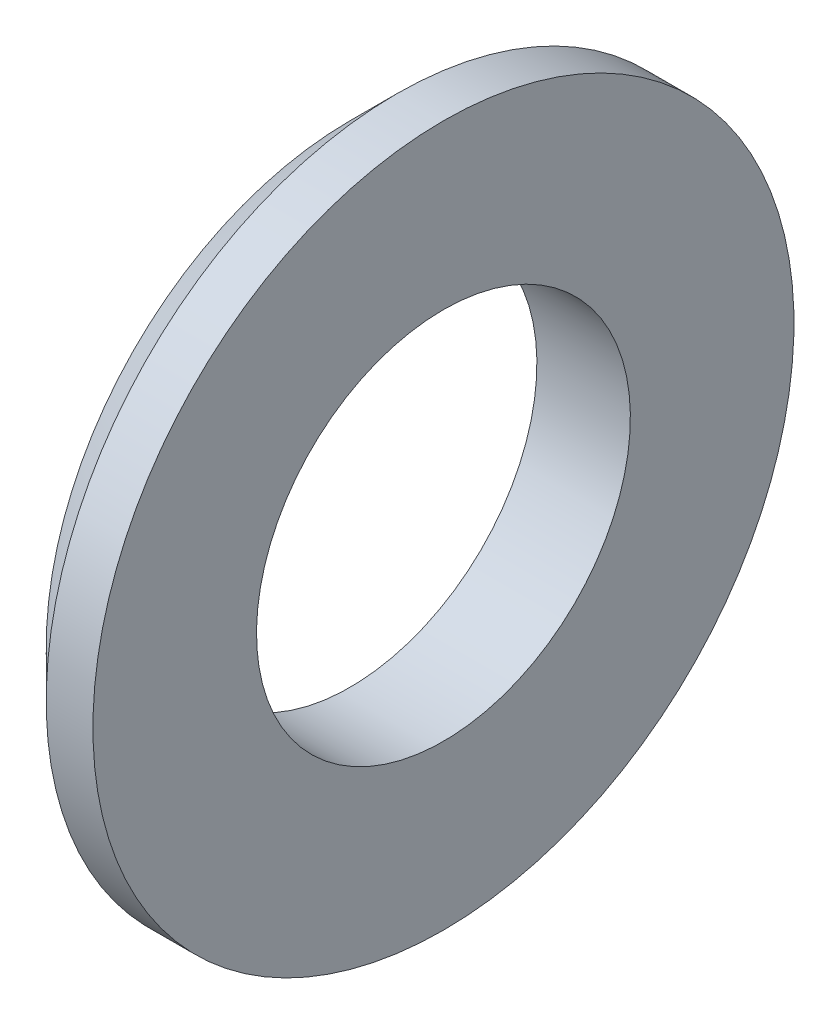
ISO-10303-21;
HEADER;
FILE_DESCRIPTION(('STEP AP214'),'2;1');
FILE_NAME('part.step','',(''),(''),'','','');
FILE_SCHEMA(('AUTOMOTIVE_DESIGN { 1 0 10303 214 1 1 1 1 }'));
ENDSEC;
DATA;
#1=APPLICATION_CONTEXT('core data for automotive mechanical design processes');
#2=APPLICATION_PROTOCOL_DEFINITION('international standard','automotive_design',2000,#1);
#3=PRODUCT_CONTEXT('',#1,'mechanical');
#4=PRODUCT('Part','Part','',(#3));
#5=PRODUCT_RELATED_PRODUCT_CATEGORY('part','',(#4));
#6=PRODUCT_DEFINITION_FORMATION('','',#4);
#7=PRODUCT_DEFINITION_CONTEXT('part definition',#1,'design');
#8=PRODUCT_DEFINITION('design','',#6,#7);
#9=PRODUCT_DEFINITION_SHAPE('','',#8);
#10=(LENGTH_UNIT() NAMED_UNIT(*) SI_UNIT(.MILLI.,.METRE.));
#11=(NAMED_UNIT(*) PLANE_ANGLE_UNIT() SI_UNIT($,.RADIAN.));
#12=(NAMED_UNIT(*) SI_UNIT($,.STERADIAN.) SOLID_ANGLE_UNIT());
#13=UNCERTAINTY_MEASURE_WITH_UNIT(LENGTH_MEASURE(1.E-05),#10,'distance_accuracy_value','');
#14=(GEOMETRIC_REPRESENTATION_CONTEXT(3) GLOBAL_UNCERTAINTY_ASSIGNED_CONTEXT((#13)) GLOBAL_UNIT_ASSIGNED_CONTEXT((#10,
#11,#12)) REPRESENTATION_CONTEXT('',''));
#15=CARTESIAN_POINT('',(0.,0.,0.));
#16=DIRECTION('',(0.,0.,1.));
#17=DIRECTION('',(1.,0.,0.));
#18=AXIS2_PLACEMENT_3D('',#15,#16,#17);
#19=CARTESIAN_POINT('',(1.6,0.,0.));
#20=DIRECTION('',(-1.,0.,0.));
#21=DIRECTION('',(0.,0.,1.));
#22=AXIS2_PLACEMENT_3D('',#19,#20,#21);
#23=PLANE('',#22);
#24=CARTESIAN_POINT('',(1.6,0.,0.));
#25=DIRECTION('',(-1.,0.,0.));
#26=DIRECTION('',(0.,-1.,0.));
#27=AXIS2_PLACEMENT_3D('',#24,#25,#26);
#28=CIRCLE('',#27,3.2);
#29=CARTESIAN_POINT('',(1.6,3.2,0.));
#30=VERTEX_POINT('',#29);
#31=EDGE_CURVE('E11',#30,#30,#28,.T.);
#32=ORIENTED_EDGE('',*,*,#31,.T.);
#33=EDGE_LOOP('',(#32));
#34=FACE_BOUND('',#33,.T.);
#35=CARTESIAN_POINT('',(1.6,0.,0.));
#36=DIRECTION('',(-1.,0.,0.));
#37=DIRECTION('',(0.,-1.,0.));
#38=AXIS2_PLACEMENT_3D('',#35,#36,#37);
#39=CIRCLE('',#38,6.);
#40=CARTESIAN_POINT('',(1.6,6.,0.));
#41=VERTEX_POINT('',#40);
#42=EDGE_CURVE('E63',#41,#41,#39,.T.);
#43=ORIENTED_EDGE('',*,*,#42,.F.);
#44=EDGE_LOOP('',(#43));
#45=FACE_BOUND('',#44,.T.);
#46=ADVANCED_FACE('F16',(#34,#45),#23,.F.);
#47=CARTESIAN_POINT('',(0.,0.,0.));
#48=DIRECTION('',(1.,0.,0.));
#49=DIRECTION('',(0.,-1.,0.));
#50=AXIS2_PLACEMENT_3D('',#47,#48,#49);
#51=CYLINDRICAL_SURFACE('',#50,3.2);
#52=CARTESIAN_POINT('',(0.,0.,0.));
#53=DIRECTION('',(1.,0.,0.));
#54=DIRECTION('',(0.,-1.,0.));
#55=AXIS2_PLACEMENT_3D('',#52,#53,#54);
#56=CIRCLE('',#55,3.2);
#57=CARTESIAN_POINT('',(0.,3.2,0.));
#58=VERTEX_POINT('',#57);
#59=EDGE_CURVE('E19',#58,#58,#56,.T.);
#60=ORIENTED_EDGE('',*,*,#59,.F.);
#61=DIRECTION('',(1.,0.,0.));
#62=VECTOR('',#61,1.);
#63=CARTESIAN_POINT('',(0.,3.2,0.));
#64=LINE('',#63,#62);
#65=EDGE_CURVE('E26',#58,#30,#64,.T.);
#66=ORIENTED_EDGE('',*,*,#65,.T.);
#67=ORIENTED_EDGE('',*,*,#31,.F.);
#68=ORIENTED_EDGE('',*,*,#65,.F.);
#69=EDGE_LOOP('',(#60,#66,#67,#68));
#70=FACE_BOUND('',#69,.T.);
#71=ADVANCED_FACE('F89',(#70),#51,.F.);
#72=CARTESIAN_POINT('',(0.,0.,0.));
#73=DIRECTION('',(-1.,0.,0.));
#74=DIRECTION('',(0.,0.,1.));
#75=AXIS2_PLACEMENT_3D('',#72,#73,#74);
#76=PLANE('',#75);
#77=ORIENTED_EDGE('',*,*,#59,.T.);
#78=EDGE_LOOP('',(#77));
#79=FACE_BOUND('',#78,.T.);
#80=CARTESIAN_POINT('',(0.,0.,0.));
#81=DIRECTION('',(1.,0.,0.));
#82=DIRECTION('',(0.,-1.,0.));
#83=AXIS2_PLACEMENT_3D('',#80,#81,#82);
#84=CIRCLE('',#83,5.2);
#85=CARTESIAN_POINT('',(0.,5.2,0.));
#86=VERTEX_POINT('',#85);
#87=EDGE_CURVE('E74',#86,#86,#84,.T.);
#88=ORIENTED_EDGE('',*,*,#87,.F.);
#89=EDGE_LOOP('',(#88));
#90=FACE_BOUND('',#89,.T.);
#91=ADVANCED_FACE('F87',(#79,#90),#76,.T.);
#92=CARTESIAN_POINT('',(0.,0.,0.));
#93=DIRECTION('',(1.,0.,0.));
#94=DIRECTION('',(0.,-1.,0.));
#95=AXIS2_PLACEMENT_3D('',#92,#93,#94);
#96=CYLINDRICAL_SURFACE('',#95,6.);
#97=ORIENTED_EDGE('',*,*,#42,.T.);
#98=DIRECTION('',(-1.,0.,0.));
#99=VECTOR('',#98,1.);
#100=CARTESIAN_POINT('',(0.,6.,0.));
#101=LINE('',#100,#99);
#102=CARTESIAN_POINT('',(0.8,6.,0.));
#103=VERTEX_POINT('',#102);
#104=EDGE_CURVE('E59',#41,#103,#101,.T.);
#105=ORIENTED_EDGE('',*,*,#104,.T.);
#106=CARTESIAN_POINT('',(0.8,0.,0.));
#107=DIRECTION('',(-1.,0.,0.));
#108=DIRECTION('',(0.,-1.,0.));
#109=AXIS2_PLACEMENT_3D('',#106,#107,#108);
#110=CIRCLE('',#109,6.);
#111=EDGE_CURVE('E61',#103,#103,#110,.T.);
#112=ORIENTED_EDGE('',*,*,#111,.F.);
#113=ORIENTED_EDGE('',*,*,#104,.F.);
#114=EDGE_LOOP('',(#97,#105,#112,#113));
#115=FACE_BOUND('',#114,.T.);
#116=ADVANCED_FACE('F60',(#115),#96,.T.);
#117=CARTESIAN_POINT('',(0.4,0.,0.));
#118=DIRECTION('',(1.,0.,0.));
#119=DIRECTION('',(0.,-1.,0.));
#120=AXIS2_PLACEMENT_3D('',#117,#118,#119);
#121=CONICAL_SURFACE('',#120,5.6,0.785398163397449);
#122=ORIENTED_EDGE('',*,*,#87,.T.);
#123=DIRECTION('',(0.707106781186547,0.707106781186548,0.));
#124=VECTOR('',#123,1.);
#125=CARTESIAN_POINT('',(0.4,5.6,0.));
#126=LINE('',#125,#124);
#127=EDGE_CURVE('E52',#86,#103,#126,.T.);
#128=ORIENTED_EDGE('',*,*,#127,.T.);
#129=ORIENTED_EDGE('',*,*,#111,.T.);
#130=ORIENTED_EDGE('',*,*,#127,.F.);
#131=EDGE_LOOP('',(#122,#128,#129,#130));
#132=FACE_BOUND('',#131,.T.);
#133=ADVANCED_FACE('F66',(#132),#121,.T.);
#134=CLOSED_SHELL('',(#46,#71,#91,#116,#133));
#135=MANIFOLD_SOLID_BREP('B1',#134);
#136=ADVANCED_BREP_SHAPE_REPRESENTATION('',(#18,#135),#14);
#137=SHAPE_DEFINITION_REPRESENTATION(#9,#136);
ENDSEC;
END-ISO-10303-21;
